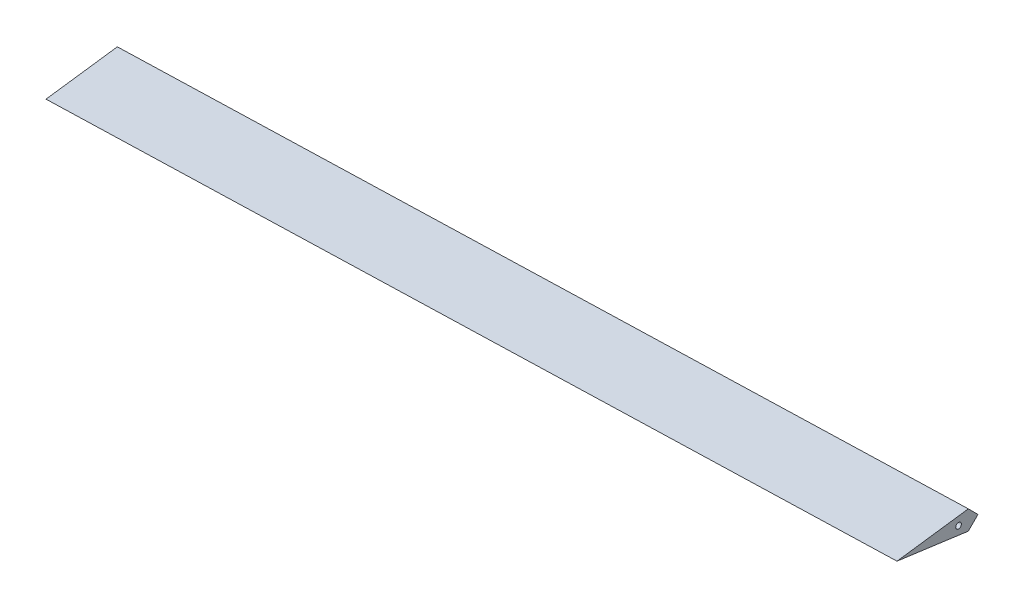
ISO-10303-21;
HEADER;
FILE_DESCRIPTION(('STEP AP214'),'2;1');
FILE_NAME('part.step','',(''),(''),'','','');
FILE_SCHEMA(('AUTOMOTIVE_DESIGN { 1 0 10303 214 1 1 1 1 }'));
ENDSEC;
DATA;
#1=APPLICATION_CONTEXT('core data for automotive mechanical design processes');
#2=APPLICATION_PROTOCOL_DEFINITION('international standard','automotive_design',2000,#1);
#3=PRODUCT_CONTEXT('',#1,'mechanical');
#4=PRODUCT('Part','Part','',(#3));
#5=PRODUCT_RELATED_PRODUCT_CATEGORY('part','',(#4));
#6=PRODUCT_DEFINITION_FORMATION('','',#4);
#7=PRODUCT_DEFINITION_CONTEXT('part definition',#1,'design');
#8=PRODUCT_DEFINITION('design','',#6,#7);
#9=PRODUCT_DEFINITION_SHAPE('','',#8);
#10=(LENGTH_UNIT() NAMED_UNIT(*) SI_UNIT(.MILLI.,.METRE.));
#11=(NAMED_UNIT(*) PLANE_ANGLE_UNIT() SI_UNIT($,.RADIAN.));
#12=(NAMED_UNIT(*) SI_UNIT($,.STERADIAN.) SOLID_ANGLE_UNIT());
#13=UNCERTAINTY_MEASURE_WITH_UNIT(LENGTH_MEASURE(1.E-05),#10,'distance_accuracy_value','');
#14=(GEOMETRIC_REPRESENTATION_CONTEXT(3) GLOBAL_UNCERTAINTY_ASSIGNED_CONTEXT((#13)) GLOBAL_UNIT_ASSIGNED_CONTEXT((#10,
#11,#12)) REPRESENTATION_CONTEXT('',''));
#15=CARTESIAN_POINT('',(0.,0.,0.));
#16=DIRECTION('',(0.,0.,1.));
#17=DIRECTION('',(1.,0.,0.));
#18=AXIS2_PLACEMENT_3D('',#15,#16,#17);
#19=CARTESIAN_POINT('',(402.631826605969,-10.8469322525921,-92.3770961577892));
#20=DIRECTION('',(-0.00413017231978283,0.990924502757163,-0.134356136860506));
#21=DIRECTION('',(0.,-0.134357282820383,-0.990932954620606));
#22=AXIS2_PLACEMENT_3D('',#19,#20,#21);
#23=PLANE('',#22);
#24=DIRECTION('',(0.,0.134357282820383,0.990932954620606));
#25=VECTOR('',#24,1.);
#26=CARTESIAN_POINT('',(402.631826605969,-10.8469322525921,-92.3770961577892));
#27=LINE('',#26,#25);
#28=CARTESIAN_POINT('',(402.631826605969,-9.43184514420549,-81.9403232495897));
#29=VERTEX_POINT('',#28);
#30=CARTESIAN_POINT('',(402.631826605969,0.,-12.3770961577892));
#31=VERTEX_POINT('',#30);
#32=EDGE_CURVE('E88',#29,#31,#27,.T.);
#33=ORIENTED_EDGE('',*,*,#32,.T.);
#34=DIRECTION('',(-0.999527846007829,0.,0.0307259671117202));
#35=VECTOR('',#34,1.);
#36=CARTESIAN_POINT('',(402.631826605969,0.,-12.3770961577892));
#37=LINE('',#36,#35);
#38=CARTESIAN_POINT('',(-402.631826605969,0.,12.3770961577892));
#39=VERTEX_POINT('',#38);
#40=EDGE_CURVE('E104',#31,#39,#37,.T.);
#41=ORIENTED_EDGE('',*,*,#40,.T.);
#42=DIRECTION('',(0.,0.134357282820383,0.990932954620606));
#43=VECTOR('',#42,1.);
#44=CARTESIAN_POINT('',(-402.631826605969,-10.8469322525921,-67.6229038422108));
#45=LINE('',#44,#43);
#46=CARTESIAN_POINT('',(-402.631826605969,-9.43184514420548,-57.1861309340112));
#47=VERTEX_POINT('',#46);
#48=EDGE_CURVE('E100',#47,#39,#45,.T.);
#49=ORIENTED_EDGE('',*,*,#48,.F.);
#50=DIRECTION('',(-0.999527846007828,0.,0.0307259671117202));
#51=VECTOR('',#50,1.);
#52=CARTESIAN_POINT('',(402.952355136784,-9.43184514420549,-81.9501764509142));
#53=LINE('',#52,#51);
#54=EDGE_CURVE('E82',#29,#47,#53,.T.);
#55=ORIENTED_EDGE('',*,*,#54,.F.);
#56=EDGE_LOOP('',(#33,#41,#49,#55));
#57=FACE_BOUND('',#56,.T.);
#58=ADVANCED_FACE('F37',(#57),#23,.F.);
#59=CARTESIAN_POINT('',(402.631826605969,10.8469322525921,-92.3770961577892));
#60=DIRECTION('',(-0.00413017231978283,-0.990924502757163,-0.134356136860506));
#61=DIRECTION('',(0.,-0.134357282820383,0.990932954620606));
#62=AXIS2_PLACEMENT_3D('',#59,#60,#61);
#63=PLANE('',#62);
#64=DIRECTION('',(0.,0.134357282820383,-0.990932954620606));
#65=VECTOR('',#64,1.);
#66=CARTESIAN_POINT('',(-402.631826605969,10.8469322525921,-67.6229038422108));
#67=LINE('',#66,#65);
#68=CARTESIAN_POINT('',(-402.631826605969,9.43184514420549,-57.1861309340112));
#69=VERTEX_POINT('',#68);
#70=EDGE_CURVE('E102',#39,#69,#67,.T.);
#71=ORIENTED_EDGE('',*,*,#70,.F.);
#72=ORIENTED_EDGE('',*,*,#40,.F.);
#73=DIRECTION('',(0.,0.134357282820383,-0.990932954620606));
#74=VECTOR('',#73,1.);
#75=CARTESIAN_POINT('',(402.631826605969,10.8469322525921,-92.3770961577892));
#76=LINE('',#75,#74);
#77=CARTESIAN_POINT('',(402.631826605969,9.43184514420549,-81.9403232495896));
#78=VERTEX_POINT('',#77);
#79=EDGE_CURVE('E60',#31,#78,#76,.T.);
#80=ORIENTED_EDGE('',*,*,#79,.T.);
#81=DIRECTION('',(0.999527846007829,0.,-0.0307259671117202));
#82=VECTOR('',#81,1.);
#83=CARTESIAN_POINT('',(402.952355136784,9.43184514420549,-81.9501764509142));
#84=LINE('',#83,#82);
#85=EDGE_CURVE('E89',#69,#78,#84,.T.);
#86=ORIENTED_EDGE('',*,*,#85,.F.);
#87=EDGE_LOOP('',(#71,#72,#80,#86));
#88=FACE_BOUND('',#87,.T.);
#89=ADVANCED_FACE('F114',(#88),#63,.F.);
#90=CARTESIAN_POINT('',(402.631826605969,0.,-12.3770961577892));
#91=DIRECTION('',(1.,0.,0.));
#92=DIRECTION('',(0.,0.,1.));
#93=AXIS2_PLACEMENT_3D('',#90,#91,#92);
#94=PLANE('',#93);
#95=CARTESIAN_POINT('',(402.631826605969,0.,-72.4054387794015));
#96=DIRECTION('',(-1.,0.,0.));
#97=DIRECTION('',(0.,0.,1.));
#98=AXIS2_PLACEMENT_3D('',#95,#96,#97);
#99=ELLIPSE('',#98,2.75129903682389,2.75);
#100=CARTESIAN_POINT('',(402.631826605969,0.,-69.6541397425776));
#101=VERTEX_POINT('',#100);
#102=EDGE_CURVE('E95',#101,#101,#99,.T.);
#103=ORIENTED_EDGE('',*,*,#102,.T.);
#104=EDGE_LOOP('',(#103));
#105=FACE_BOUND('',#104,.T.);
#106=DIRECTION('',(0.,0.706939790414691,0.707273732531071));
#107=VECTOR('',#106,1.);
#108=CARTESIAN_POINT('',(402.631826605969,39.4997594065781,-51.8582055952733));
#109=LINE('',#108,#107);
#110=CARTESIAN_POINT('',(402.631826605969,0.,-91.3766237807624));
#111=VERTEX_POINT('',#110);
#112=EDGE_CURVE('E85',#111,#78,#109,.T.);
#113=ORIENTED_EDGE('',*,*,#112,.T.);
#114=ORIENTED_EDGE('',*,*,#79,.F.);
#115=ORIENTED_EDGE('',*,*,#32,.F.);
#116=DIRECTION('',(0.,0.706939790414691,-0.707273732531071));
#117=VECTOR('',#116,1.);
#118=CARTESIAN_POINT('',(402.631826605969,-39.4997594065781,-51.8582055952733));
#119=LINE('',#118,#117);
#120=EDGE_CURVE('E80',#29,#111,#119,.T.);
#121=ORIENTED_EDGE('',*,*,#120,.T.);
#122=EDGE_LOOP('',(#113,#114,#115,#121));
#123=FACE_BOUND('',#122,.T.);
#124=ADVANCED_FACE('F84',(#105,#123),#94,.T.);
#125=CARTESIAN_POINT('',(-402.631826605969,0.,12.3770961577892));
#126=DIRECTION('',(1.,0.,0.));
#127=DIRECTION('',(0.,0.,1.));
#128=AXIS2_PLACEMENT_3D('',#125,#126,#127);
#129=PLANE('',#128);
#130=CARTESIAN_POINT('',(-402.631826605969,0.,-47.651246463823));
#131=DIRECTION('',(-1.,0.,0.));
#132=DIRECTION('',(0.,0.,1.));
#133=AXIS2_PLACEMENT_3D('',#130,#131,#132);
#134=ELLIPSE('',#133,2.75129903682389,2.75);
#135=CARTESIAN_POINT('',(-402.631826605969,0.,-44.8999474269991));
#136=VERTEX_POINT('',#135);
#137=EDGE_CURVE('E40',#136,#136,#134,.T.);
#138=ORIENTED_EDGE('',*,*,#137,.F.);
#139=EDGE_LOOP('',(#138));
#140=FACE_BOUND('',#139,.T.);
#141=DIRECTION('',(0.,0.706939790414691,-0.707273732531071));
#142=VECTOR('',#141,1.);
#143=CARTESIAN_POINT('',(-402.631826605969,-39.4997594065781,-27.1040132796948));
#144=LINE('',#143,#142);
#145=CARTESIAN_POINT('',(-402.631826605969,0.,-66.6224314651839));
#146=VERTEX_POINT('',#145);
#147=EDGE_CURVE('E45',#47,#146,#144,.T.);
#148=ORIENTED_EDGE('',*,*,#147,.F.);
#149=ORIENTED_EDGE('',*,*,#48,.T.);
#150=ORIENTED_EDGE('',*,*,#70,.T.);
#151=DIRECTION('',(0.,0.706939790414691,0.707273732531071));
#152=VECTOR('',#151,1.);
#153=CARTESIAN_POINT('',(-402.631826605969,39.4997594065781,-27.1040132796948));
#154=LINE('',#153,#152);
#155=EDGE_CURVE('E11',#146,#69,#154,.T.);
#156=ORIENTED_EDGE('',*,*,#155,.F.);
#157=EDGE_LOOP('',(#148,#149,#150,#156));
#158=FACE_BOUND('',#157,.T.);
#159=ADVANCED_FACE('F116',(#140,#158),#129,.F.);
#160=CARTESIAN_POINT('',(402.995835056737,10.8469322525921,-80.5357574815551));
#161=DIRECTION('',(0.0217265397032121,-0.707106781186551,0.706772917896915));
#162=DIRECTION('',(0.,0.706939790414691,0.707273732531071));
#163=AXIS2_PLACEMENT_3D('',#160,#161,#162);
#164=PLANE('',#163);
#165=ORIENTED_EDGE('',*,*,#112,.F.);
#166=DIRECTION('',(-0.999527846007829,0.,0.0307259671117202));
#167=VECTOR('',#166,1.);
#168=CARTESIAN_POINT('',(402.66255257308,0.,-91.3775683117814));
#169=LINE('',#168,#167);
#170=EDGE_CURVE('E51',#111,#146,#169,.T.);
#171=ORIENTED_EDGE('',*,*,#170,.T.);
#172=ORIENTED_EDGE('',*,*,#155,.T.);
#173=ORIENTED_EDGE('',*,*,#85,.T.);
#174=EDGE_LOOP('',(#165,#171,#172,#173));
#175=FACE_BOUND('',#174,.T.);
#176=ADVANCED_FACE('F91',(#175),#164,.F.);
#177=CARTESIAN_POINT('',(402.66255257308,0.,-91.3775683117814));
#178=DIRECTION('',(0.0217265397032121,0.707106781186551,0.706772917896915));
#179=DIRECTION('',(0.,0.706939790414691,-0.707273732531071));
#180=AXIS2_PLACEMENT_3D('',#177,#178,#179);
#181=PLANE('',#180);
#182=ORIENTED_EDGE('',*,*,#120,.F.);
#183=ORIENTED_EDGE('',*,*,#54,.T.);
#184=ORIENTED_EDGE('',*,*,#147,.T.);
#185=ORIENTED_EDGE('',*,*,#170,.F.);
#186=EDGE_LOOP('',(#182,#183,#184,#185));
#187=FACE_BOUND('',#186,.T.);
#188=ADVANCED_FACE('F78',(#187),#181,.F.);
#189=CARTESIAN_POINT('',(403.24518535716,0.,-72.424293722655));
#190=DIRECTION('',(-0.999527846007829,0.,0.0307259671117202));
#191=DIRECTION('',(-0.0307259671117202,0.,-0.999527846007829));
#192=AXIS2_PLACEMENT_3D('',#189,#190,#191);
#193=CYLINDRICAL_SURFACE('',#192,2.75);
#194=ORIENTED_EDGE('',*,*,#102,.F.);
#195=EDGE_LOOP('',(#194));
#196=FACE_BOUND('',#195,.T.);
#197=ORIENTED_EDGE('',*,*,#137,.T.);
#198=EDGE_LOOP('',(#197));
#199=FACE_BOUND('',#198,.T.);
#200=ADVANCED_FACE('F158',(#196,#199),#193,.F.);
#201=CLOSED_SHELL('',(#58,#89,#124,#159,#176,#188,#200));
#202=MANIFOLD_SOLID_BREP('B2',#201);
#203=ADVANCED_BREP_SHAPE_REPRESENTATION('',(#18,#202),#14);
#204=SHAPE_DEFINITION_REPRESENTATION(#9,#203);
ENDSEC;
END-ISO-10303-21;
